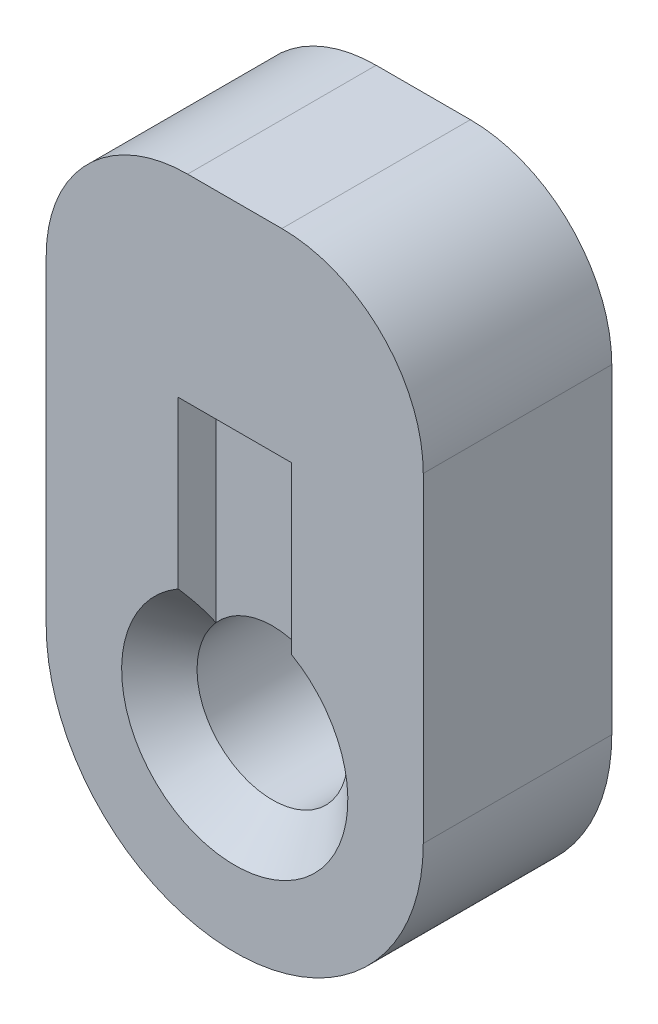
ISO-10303-21;
HEADER;
FILE_DESCRIPTION(('STEP AP214'),'2;1');
FILE_NAME('part.step','',(''),(''),'','','');
FILE_SCHEMA(('AUTOMOTIVE_DESIGN { 1 0 10303 214 1 1 1 1 }'));
ENDSEC;
DATA;
#1=APPLICATION_CONTEXT('core data for automotive mechanical design processes');
#2=APPLICATION_PROTOCOL_DEFINITION('international standard','automotive_design',2000,#1);
#3=PRODUCT_CONTEXT('',#1,'mechanical');
#4=PRODUCT('Part','Part','',(#3));
#5=PRODUCT_RELATED_PRODUCT_CATEGORY('part','',(#4));
#6=PRODUCT_DEFINITION_FORMATION('','',#4);
#7=PRODUCT_DEFINITION_CONTEXT('part definition',#1,'design');
#8=PRODUCT_DEFINITION('design','',#6,#7);
#9=PRODUCT_DEFINITION_SHAPE('','',#8);
#10=(LENGTH_UNIT() NAMED_UNIT(*) SI_UNIT(.MILLI.,.METRE.));
#11=(NAMED_UNIT(*) PLANE_ANGLE_UNIT() SI_UNIT($,.RADIAN.));
#12=(NAMED_UNIT(*) SI_UNIT($,.STERADIAN.) SOLID_ANGLE_UNIT());
#13=UNCERTAINTY_MEASURE_WITH_UNIT(LENGTH_MEASURE(1.E-05),#10,'distance_accuracy_value','');
#14=(GEOMETRIC_REPRESENTATION_CONTEXT(3) GLOBAL_UNCERTAINTY_ASSIGNED_CONTEXT((#13)) GLOBAL_UNIT_ASSIGNED_CONTEXT((#10,
#11,#12)) REPRESENTATION_CONTEXT('',''));
#15=CARTESIAN_POINT('',(0.,0.,0.));
#16=DIRECTION('',(0.,0.,1.));
#17=DIRECTION('',(1.,0.,0.));
#18=AXIS2_PLACEMENT_3D('',#15,#16,#17);
#19=CARTESIAN_POINT('',(0.,0.,2.54));
#20=DIRECTION('',(0.,0.,-1.));
#21=DIRECTION('',(-1.,0.,0.));
#22=AXIS2_PLACEMENT_3D('',#19,#20,#21);
#23=CYLINDRICAL_SURFACE('',#22,1.016);
#24=CARTESIAN_POINT('',(0.,0.,0.508));
#25=DIRECTION('',(0.,0.,-1.));
#26=DIRECTION('',(-1.,0.,0.));
#27=AXIS2_PLACEMENT_3D('',#24,#25,#26);
#28=CIRCLE('',#27,1.016);
#29=CARTESIAN_POINT('',(0.762,0.672020833010429,0.508));
#30=VERTEX_POINT('',#29);
#31=CARTESIAN_POINT('',(-0.762000000000013,0.672020833010416,0.508));
#32=VERTEX_POINT('',#31);
#33=EDGE_CURVE('E562',#30,#32,#28,.F.);
#34=ORIENTED_EDGE('',*,*,#33,.F.);
#35=CARTESIAN_POINT('',(0.,0.,0.508000000000016));
#36=DIRECTION('',(0.,0.,-1.));
#37=DIRECTION('',(-1.,0.,0.));
#38=AXIS2_PLACEMENT_3D('',#35,#36,#37);
#39=CIRCLE('',#38,1.016);
#40=EDGE_CURVE('E143',#30,#32,#39,.T.);
#41=ORIENTED_EDGE('',*,*,#40,.T.);
#42=EDGE_LOOP('',(#34,#41));
#43=FACE_BOUND('',#42,.T.);
#44=CARTESIAN_POINT('',(0.,0.,2.032));
#45=DIRECTION('',(0.,0.,1.));
#46=DIRECTION('',(1.,0.,0.));
#47=AXIS2_PLACEMENT_3D('',#44,#45,#46);
#48=CIRCLE('',#47,1.016);
#49=CARTESIAN_POINT('',(-0.762000000000001,0.672020833010413,2.032));
#50=VERTEX_POINT('',#49);
#51=CARTESIAN_POINT('',(0.762000000000004,0.672020833010409,2.032));
#52=VERTEX_POINT('',#51);
#53=EDGE_CURVE('E192',#50,#52,#48,.F.);
#54=ORIENTED_EDGE('',*,*,#53,.F.);
#55=CARTESIAN_POINT('',(0.,0.,2.03199999999999));
#56=DIRECTION('',(0.,0.,1.));
#57=DIRECTION('',(1.,0.,0.));
#58=AXIS2_PLACEMENT_3D('',#55,#56,#57);
#59=CIRCLE('',#58,1.016);
#60=EDGE_CURVE('E165',#50,#52,#59,.T.);
#61=ORIENTED_EDGE('',*,*,#60,.T.);
#62=EDGE_LOOP('',(#54,#61));
#63=FACE_BOUND('',#62,.T.);
#64=ADVANCED_FACE('F41',(#43,#63),#23,.F.);
#65=CARTESIAN_POINT('',(-0.762000000000001,0.,2.032));
#66=DIRECTION('',(-1.,0.,0.));
#67=DIRECTION('',(0.,0.,1.));
#68=AXIS2_PLACEMENT_3D('',#65,#66,#67);
#69=PLANE('',#68);
#70=CARTESIAN_POINT('',(-0.762000000000001,-0.320112885029406,1.84250847494859));
#71=CARTESIAN_POINT('',(-0.762000000000001,-0.295333553365384,1.83290636944236));
#72=CARTESIAN_POINT('',(-0.762000000000001,-0.270205778967705,1.82412531153175));
#73=CARTESIAN_POINT('',(-0.762000000000001,-0.219279308727766,1.80855318599059));
#74=CARTESIAN_POINT('',(-0.762000000000001,-0.193479145095385,1.80176695346473));
#75=CARTESIAN_POINT('',(-0.762000000000001,-0.141824715607705,1.79068312579393));
#76=CARTESIAN_POINT('',(-0.762000000000001,-0.115979848676879,1.78634278389228));
#77=CARTESIAN_POINT('',(-0.762000000000001,-0.0640080043353284,1.78024889633141));
#78=CARTESIAN_POINT('',(-0.762000000000001,-0.0378813393353045,1.7784927338415));
#79=CARTESIAN_POINT('',(-0.762000000000001,0.0135364612752595,1.77770144140581));
#80=CARTESIAN_POINT('',(-0.762000000000001,0.0388261998534757,1.77857693857625));
#81=CARTESIAN_POINT('',(-0.762000000000001,0.089204692449845,1.78279152828026));
#82=CARTESIAN_POINT('',(-0.762000000000001,0.114293344654479,1.78613179782516));
#83=CARTESIAN_POINT('',(-0.762000000000001,0.188998481514829,1.79956372082769));
#84=CARTESIAN_POINT('',(-0.762000000000001,0.238010241197525,1.81306659996416));
#85=CARTESIAN_POINT('',(-0.762000000000001,0.335647478318469,1.84732319180735));
#86=CARTESIAN_POINT('',(-0.762000000000001,0.384165580939922,1.86836391130572));
#87=CARTESIAN_POINT('',(-0.762000000000001,0.478965921312955,1.91508463327411));
#88=CARTESIAN_POINT('',(-0.762000000000001,0.525243542700618,1.94077373742472));
#89=CARTESIAN_POINT('',(-0.762000000000001,0.616770009042437,1.99563444778393));
#90=CARTESIAN_POINT('',(-0.762000000000001,0.661986045509693,2.02485974331733));
#91=CARTESIAN_POINT('',(-0.762000000000001,0.750951469043454,2.08535304604002));
#92=CARTESIAN_POINT('',(-0.762000000000001,0.794702182311347,2.11661912622096));
#93=CARTESIAN_POINT('',(-0.762000000000001,0.911413460169346,2.2029502583023));
#94=CARTESIAN_POINT('',(-0.762000000000001,0.983379073223906,2.25935171884097));
#95=CARTESIAN_POINT('',(-0.762000000000001,1.12542139977116,2.37449674969511));
#96=CARTESIAN_POINT('',(-0.762000000000001,1.19549743360379,2.43324114438863));
#97=CARTESIAN_POINT('',(-0.762000000000001,1.33448584164571,2.55229764416072));
#98=CARTESIAN_POINT('',(-0.762000000000001,1.40339628502007,2.61261199660617));
#99=CARTESIAN_POINT('',(-0.762000000000001,1.54034092149377,2.73422808104102));
#100=CARTESIAN_POINT('',(-0.762000000000001,1.60837508129857,2.79552985034949));
#101=CARTESIAN_POINT('',(-0.762000000000001,1.73708890097997,2.9127042284456));
#102=CARTESIAN_POINT('',(-0.762000000000001,1.79782808883558,2.96851157096941));
#103=CARTESIAN_POINT('',(-0.762000000000001,1.91891904470457,3.08055019785734));
#104=CARTESIAN_POINT('',(-0.762000000000001,1.97927079436488,3.13678150203428));
#105=CARTESIAN_POINT('',(-0.762000000000001,2.09948522538936,3.24939197548309));
#106=CARTESIAN_POINT('',(-0.762000000000001,2.15934884272821,3.3057701466671));
#107=CARTESIAN_POINT('',(-0.762000000000001,2.27883046181757,3.41877836535408));
#108=CARTESIAN_POINT('',(-0.762000000000001,2.33844847952092,3.47540839598437));
#109=CARTESIAN_POINT('',(-0.762000000000001,2.39797516397831,3.53213371803982));
#110=B_SPLINE_CURVE_WITH_KNOTS('',3,(#70,#71,#72,#73,#74,#75,#76,#77,#78,#79,#80,#81,#82,#83,
#84,#85,#86,#87,#88,#89,#90,#91,#92,#93,#94,#95,#96,#97,#98,#99,#100,#101,#102,#103,#104,#105,
#106,#107,#108,#109),.UNSPECIFIED.,.F.,.F.,(4,2,2,2,2,2,2,2,2,2,2,2,2,2,2,2,2,2,2,4),(0.,
0.0797522408543494,0.159696222594933,0.238195867700949,0.31661596647901,0.392403294084258,
0.468226836116276,0.620003493762815,0.778311228022764,0.936932355595322,1.09836706998341,
1.25965149539109,1.53385513955007,1.80815613042058,2.08287409239533,2.35760246171224,
2.60505370840901,2.85251659170748,3.0992126774344,3.34589247812601),.UNSPECIFIED.);
#111=CARTESIAN_POINT('',(-0.762000000000001,1.31982271536748,2.54));
#112=VERTEX_POINT('',#111);
#113=EDGE_CURVE('E172',#50,#112,#110,.T.);
#114=ORIENTED_EDGE('',*,*,#113,.F.);
#115=DIRECTION('',(0.,-1.,0.));
#116=VECTOR('',#115,1.);
#117=CARTESIAN_POINT('',(-0.762000000000001,0.,2.032));
#118=LINE('',#117,#116);
#119=CARTESIAN_POINT('',(-0.762000000000001,3.556,2.032));
#120=VERTEX_POINT('',#119);
#121=EDGE_CURVE('E188',#120,#50,#118,.T.);
#122=ORIENTED_EDGE('',*,*,#121,.F.);
#123=DIRECTION('',(0.,0.,1.));
#124=VECTOR('',#123,1.);
#125=CARTESIAN_POINT('',(-0.762000000000001,3.556,2.032));
#126=LINE('',#125,#124);
#127=CARTESIAN_POINT('',(-0.762000000000001,3.556,2.54));
#128=VERTEX_POINT('',#127);
#129=EDGE_CURVE('E215',#120,#128,#126,.T.);
#130=ORIENTED_EDGE('',*,*,#129,.T.);
#131=DIRECTION('',(0.,-1.,0.));
#132=VECTOR('',#131,1.);
#133=CARTESIAN_POINT('',(-0.762000000000001,0.,2.54));
#134=LINE('',#133,#132);
#135=EDGE_CURVE('E183',#128,#112,#134,.T.);
#136=ORIENTED_EDGE('',*,*,#135,.T.);
#137=EDGE_LOOP('',(#114,#122,#130,#136));
#138=FACE_BOUND('',#137,.T.);
#139=ADVANCED_FACE('F315',(#138),#69,.F.);
#140=CARTESIAN_POINT('',(0.762000000000001,0.,2.032));
#141=DIRECTION('',(1.,0.,0.));
#142=DIRECTION('',(0.,1.,0.));
#143=AXIS2_PLACEMENT_3D('',#140,#141,#142);
#144=PLANE('',#143);
#145=CARTESIAN_POINT('',(0.762,2.39797516397831,3.53213371803981));
#146=CARTESIAN_POINT('',(0.762,2.32873931674914,3.46616039267172));
#147=CARTESIAN_POINT('',(0.762,2.25938285096078,3.40031275907171));
#148=CARTESIAN_POINT('',(0.762,2.12032476999515,3.26897252871197));
#149=CARTESIAN_POINT('',(0.762,2.050623129003,3.20347995929806));
#150=CARTESIAN_POINT('',(0.762,1.91093693713539,3.07310884917095));
#151=CARTESIAN_POINT('',(0.762,1.840953361568,3.0082292660561));
#152=CARTESIAN_POINT('',(0.762,1.70039435861494,2.87912022187955));
#153=CARTESIAN_POINT('',(0.762,1.6298189537208,2.81489073631485));
#154=CARTESIAN_POINT('',(0.762,1.46664134261578,2.66827439786695));
#155=CARTESIAN_POINT('',(0.762,1.3737586389346,2.58619666171781));
#156=CARTESIAN_POINT('',(0.762,1.23263801134836,2.46495534199683));
#157=CARTESIAN_POINT('',(0.762,1.18524464164697,2.42481050048725));
#158=CARTESIAN_POINT('',(0.762,1.08970679767788,2.34543347189523));
#159=CARTESIAN_POINT('',(0.762,1.04156242296529,2.30620116553391));
#160=CARTESIAN_POINT('',(0.762,0.947477847785198,2.23156286423435));
#161=CARTESIAN_POINT('',(0.762,0.901602549094888,2.19607544441393));
#162=CARTESIAN_POINT('',(0.762,0.80866866053499,2.12668940794581));
#163=CARTESIAN_POINT('',(0.762,0.761610291067495,2.09279049868499));
#164=CARTESIAN_POINT('',(0.762,0.665924682694298,2.02737427180279));
#165=CARTESIAN_POINT('',(0.762,0.617299242056743,1.99585435397701));
#166=CARTESIAN_POINT('',(0.762,0.517890221653922,1.93646959833464));
#167=CARTESIAN_POINT('',(0.762000000000001,0.467109404827834,1.90860025772468));
#168=CARTESIAN_POINT('',(0.762000000000001,0.367695882962378,1.861058228643));
#169=CARTESIAN_POINT('',(0.762000000000001,0.31932355521645,1.84085603108713));
#170=CARTESIAN_POINT('',(0.762000000000001,0.220205152376706,1.8078278857344));
#171=CARTESIAN_POINT('',(0.762000000000001,0.169471551906662,1.79496708311052));
#172=CARTESIAN_POINT('',(0.762000000000001,0.0918201824293839,1.7830719736912));
#173=CARTESIAN_POINT('',(0.762000000000001,0.0654557860224722,1.78034861998438));
#174=CARTESIAN_POINT('',(0.762000000000001,0.0125801610505859,1.77764797533753));
#175=CARTESIAN_POINT('',(0.762000000000001,-0.0139310649855619,1.77767063724941));
#176=CARTESIAN_POINT('',(0.762000000000001,-0.0668797202015237,1.78047036915518));
#177=CARTESIAN_POINT('',(0.762000000000001,-0.0933167177784668,1.78325536159827));
#178=CARTESIAN_POINT('',(0.762000000000001,-0.145795105763024,1.79138862314452));
#179=CARTESIAN_POINT('',(0.762000000000001,-0.171836374335675,1.79673766579477));
#180=CARTESIAN_POINT('',(0.762000000000001,-0.218464555083557,1.80844029670378));
#181=CARTESIAN_POINT('',(0.762000000000001,-0.23915007949053,1.81441154810352));
#182=CARTESIAN_POINT('',(0.762000000000001,-0.279998495995666,1.82758572915144));
#183=CARTESIAN_POINT('',(0.762000000000001,-0.30016367422565,1.83478153796503));
#184=CARTESIAN_POINT('',(0.762000000000001,-0.320112885029432,1.84250847494848));
#185=B_SPLINE_CURVE_WITH_KNOTS('',3,(#145,#146,#147,#148,#149,#150,#151,#152,#153,#154,#155,
#156,#157,#158,#159,#160,#161,#162,#163,#164,#165,#166,#167,#168,#169,#170,#171,#172,#173,#174,
#175,#176,#177,#178,#179,#180,#181,#182,#183,#184),.UNSPECIFIED.,.F.,.F.,(4,2,2,2,2,2,2,2,2,2,2,
2,2,2,2,2,2,2,2,4),(0.,0.28690614863427,0.573834088531817,0.860123242809433,1.14640156599761,
1.51822037764353,1.70454484153626,1.89084481222558,2.06481940011078,2.23876181383742,
2.41251127181324,2.58604435947118,2.74295026876841,2.89910490214274,2.97849141537674,
3.05787656557321,3.13749005510215,3.21712757831782,3.28167668025887,3.34586250911327),.UNSPECIFIED.);
#186=CARTESIAN_POINT('',(0.762,1.31982271536748,2.54));
#187=VERTEX_POINT('',#186);
#188=EDGE_CURVE('E344',#187,#52,#185,.T.);
#189=ORIENTED_EDGE('',*,*,#188,.F.);
#190=DIRECTION('',(0.,1.,0.));
#191=VECTOR('',#190,1.);
#192=CARTESIAN_POINT('',(0.762000000000001,0.,2.54));
#193=LINE('',#192,#191);
#194=CARTESIAN_POINT('',(0.761999999999999,3.556,2.54));
#195=VERTEX_POINT('',#194);
#196=EDGE_CURVE('E209',#187,#195,#193,.T.);
#197=ORIENTED_EDGE('',*,*,#196,.T.);
#198=DIRECTION('',(0.,0.,1.));
#199=VECTOR('',#198,1.);
#200=CARTESIAN_POINT('',(0.761999999999999,3.556,2.032));
#201=LINE('',#200,#199);
#202=CARTESIAN_POINT('',(0.761999999999999,3.556,2.032));
#203=VERTEX_POINT('',#202);
#204=EDGE_CURVE('E205',#203,#195,#201,.T.);
#205=ORIENTED_EDGE('',*,*,#204,.F.);
#206=DIRECTION('',(0.,1.,0.));
#207=VECTOR('',#206,1.);
#208=CARTESIAN_POINT('',(0.762000000000001,0.,2.032));
#209=LINE('',#208,#207);
#210=EDGE_CURVE('E197',#52,#203,#209,.T.);
#211=ORIENTED_EDGE('',*,*,#210,.F.);
#212=EDGE_LOOP('',(#189,#197,#205,#211));
#213=FACE_BOUND('',#212,.T.);
#214=ADVANCED_FACE('F321',(#213),#144,.F.);
#215=CARTESIAN_POINT('',(0.762000000000001,0.,0.508));
#216=DIRECTION('',(1.,0.,0.));
#217=DIRECTION('',(0.,1.,0.));
#218=AXIS2_PLACEMENT_3D('',#215,#216,#217);
#219=PLANE('',#218);
#220=CARTESIAN_POINT('',(0.762000000000001,-0.320112885029424,0.697491525051413));
#221=CARTESIAN_POINT('',(0.762000000000001,-0.2953335533654,0.707093630557645));
#222=CARTESIAN_POINT('',(0.762000000000001,-0.27020577896772,0.715874688468248));
#223=CARTESIAN_POINT('',(0.762000000000001,-0.219279308727779,0.731446814009408));
#224=CARTESIAN_POINT('',(0.762000000000001,-0.193479145095397,0.738233046535275));
#225=CARTESIAN_POINT('',(0.762000000000001,-0.141824715607715,0.749316874206072));
#226=CARTESIAN_POINT('',(0.762000000000001,-0.115979848676887,0.753657216107724));
#227=CARTESIAN_POINT('',(0.762000000000001,-0.0640080043353342,0.759751103668595));
#228=CARTESIAN_POINT('',(0.762000000000001,-0.037881339335309,0.761507266158503));
#229=CARTESIAN_POINT('',(0.762000000000001,0.0135364612752571,0.762298558594195));
#230=CARTESIAN_POINT('',(0.762000000000001,0.0388261998534742,0.761423061423751));
#231=CARTESIAN_POINT('',(0.762000000000001,0.0892046924498453,0.757208471719742));
#232=CARTESIAN_POINT('',(0.762000000000001,0.11429334465448,0.753868202174842));
#233=CARTESIAN_POINT('',(0.762000000000001,0.188998481514833,0.740436279172312));
#234=CARTESIAN_POINT('',(0.762000000000001,0.238010241197531,0.726933400035848));
#235=CARTESIAN_POINT('',(0.762000000000001,0.335647478318479,0.692676808192649));
#236=CARTESIAN_POINT('',(0.762000000000001,0.384165580939933,0.671636088694282));
#237=CARTESIAN_POINT('',(0.762000000000001,0.47896592131297,0.624915366725886));
#238=CARTESIAN_POINT('',(0.762,0.525243542700636,0.59922626257528));
#239=CARTESIAN_POINT('',(0.762,0.616770009042458,0.544365552216063));
#240=CARTESIAN_POINT('',(0.762,0.661986045509717,0.515140256682668));
#241=CARTESIAN_POINT('',(0.762,0.750951469043482,0.454646953959971));
#242=CARTESIAN_POINT('',(0.762,0.794702182311376,0.423380873779028));
#243=CARTESIAN_POINT('',(0.762,0.911413460169378,0.33704974169769));
#244=CARTESIAN_POINT('',(0.762,0.983379073223939,0.280648281159015));
#245=CARTESIAN_POINT('',(0.762,1.1254213997712,0.165503250304881));
#246=CARTESIAN_POINT('',(0.762,1.19549743360383,0.106758855611355));
#247=CARTESIAN_POINT('',(0.762,1.33448584164575,-0.0122976441607343));
#248=CARTESIAN_POINT('',(0.762,1.40339628502011,-0.0726119966061819));
#249=CARTESIAN_POINT('',(0.762,1.54034092149381,-0.194228081041035));
#250=CARTESIAN_POINT('',(0.762,1.60837508129862,-0.255529850349503));
#251=CARTESIAN_POINT('',(0.762,1.73708890098001,-0.372704228445616));
#252=CARTESIAN_POINT('',(0.762,1.79782808883563,-0.42851157096942));
#253=CARTESIAN_POINT('',(0.762,1.91891904470461,-0.540550197857357));
#254=CARTESIAN_POINT('',(0.762,1.97927079436492,-0.596781502034295));
#255=CARTESIAN_POINT('',(0.762,2.09948522538942,-0.709391975483098));
#256=CARTESIAN_POINT('',(0.762,2.15934884272826,-0.765770146667111));
#257=CARTESIAN_POINT('',(0.762,2.27883046181762,-0.878778365354089));
#258=CARTESIAN_POINT('',(0.762,2.33844847952097,-0.935408395984384));
#259=CARTESIAN_POINT('',(0.762,2.39797516397837,-0.99213371803983));
#260=B_SPLINE_CURVE_WITH_KNOTS('',3,(#220,#221,#222,#223,#224,#225,#226,#227,#228,#229,#230,
#231,#232,#233,#234,#235,#236,#237,#238,#239,#240,#241,#242,#243,#244,#245,#246,#247,#248,#249,
#250,#251,#252,#253,#254,#255,#256,#257,#258,#259),.UNSPECIFIED.,.F.,.F.,(4,2,2,2,2,2,2,2,2,2,2,
2,2,2,2,2,2,2,2,4),(0.,0.0797522408543532,0.159696222594941,0.23819586770096,0.316615966479025,
0.392403294084276,0.468226836116297,0.620003493762841,0.778311228022797,0.936932355595361,
1.09836706998345,1.25965149539114,1.53385513955013,1.80815613042064,2.08287409239539,
2.3576024617123,2.60505370840908,2.85251659170755,3.09921267743447,3.34589247812608),.UNSPECIFIED.);
#261=CARTESIAN_POINT('',(0.762,1.31982271536751,0.));
#262=VERTEX_POINT('',#261);
#263=EDGE_CURVE('E140',#30,#262,#260,.T.);
#264=ORIENTED_EDGE('',*,*,#263,.F.);
#265=DIRECTION('',(0.,-1.,0.));
#266=VECTOR('',#265,1.);
#267=CARTESIAN_POINT('',(0.762000000000001,0.,0.508));
#268=LINE('',#267,#266);
#269=CARTESIAN_POINT('',(0.761999999999999,3.556,0.508));
#270=VERTEX_POINT('',#269);
#271=EDGE_CURVE('E180',#270,#30,#268,.T.);
#272=ORIENTED_EDGE('',*,*,#271,.F.);
#273=DIRECTION('',(0.,0.,-1.));
#274=VECTOR('',#273,1.);
#275=CARTESIAN_POINT('',(0.761999999999999,3.556,0.508));
#276=LINE('',#275,#274);
#277=CARTESIAN_POINT('',(0.761999999999999,3.556,0.));
#278=VERTEX_POINT('',#277);
#279=EDGE_CURVE('E162',#270,#278,#276,.T.);
#280=ORIENTED_EDGE('',*,*,#279,.T.);
#281=DIRECTION('',(0.,-1.,0.));
#282=VECTOR('',#281,1.);
#283=CARTESIAN_POINT('',(0.762000000000001,0.,0.));
#284=LINE('',#283,#282);
#285=EDGE_CURVE('E157',#278,#262,#284,.T.);
#286=ORIENTED_EDGE('',*,*,#285,.T.);
#287=EDGE_LOOP('',(#264,#272,#280,#286));
#288=FACE_BOUND('',#287,.T.);
#289=ADVANCED_FACE('F161',(#288),#219,.F.);
#290=CARTESIAN_POINT('',(-0.762000000000001,0.,0.508));
#291=DIRECTION('',(-1.,0.,0.));
#292=DIRECTION('',(0.,0.,1.));
#293=AXIS2_PLACEMENT_3D('',#290,#291,#292);
#294=PLANE('',#293);
#295=CARTESIAN_POINT('',(-0.762000000000001,2.39797516397838,-0.992133718039835));
#296=CARTESIAN_POINT('',(-0.762000000000001,2.3287393167492,-0.92616039267174));
#297=CARTESIAN_POINT('',(-0.762000000000001,2.25938285096084,-0.860312759071731));
#298=CARTESIAN_POINT('',(-0.762000000000001,2.12032476999521,-0.728972528711984));
#299=CARTESIAN_POINT('',(-0.762000000000001,2.05062312900305,-0.663479959298074));
#300=CARTESIAN_POINT('',(-0.762000000000001,1.91093693713544,-0.533108849170966));
#301=CARTESIAN_POINT('',(-0.762000000000001,1.84095336156804,-0.468229266056115));
#302=CARTESIAN_POINT('',(-0.762000000000001,1.70039435861499,-0.339120221879564));
#303=CARTESIAN_POINT('',(-0.762000000000001,1.62981895372084,-0.274890736314859));
#304=CARTESIAN_POINT('',(-0.762000000000001,1.46664134261582,-0.128274397866957));
#305=CARTESIAN_POINT('',(-0.762000000000001,1.37375863893464,-0.0461966617178121));
#306=CARTESIAN_POINT('',(-0.762000000000001,1.23263801134839,0.0750446580031614));
#307=CARTESIAN_POINT('',(-0.762000000000001,1.18524464164699,0.115189499512746));
#308=CARTESIAN_POINT('',(-0.762000000000001,1.0897067976779,0.194566528104768));
#309=CARTESIAN_POINT('',(-0.762000000000001,1.04156242296531,0.233798834466091));
#310=CARTESIAN_POINT('',(-0.762000000000001,0.947477847785219,0.308437135765644));
#311=CARTESIAN_POINT('',(-0.762000000000001,0.901602549094908,0.343924555586069));
#312=CARTESIAN_POINT('',(-0.762000000000001,0.808668660535009,0.413310592054184));
#313=CARTESIAN_POINT('',(-0.762000000000001,0.761610291067513,0.447209501315008));
#314=CARTESIAN_POINT('',(-0.762000000000001,0.665924682694314,0.512625728197209));
#315=CARTESIAN_POINT('',(-0.762000000000001,0.617299242056758,0.544145646022987));
#316=CARTESIAN_POINT('',(-0.762000000000001,0.517890221653935,0.603530401665366));
#317=CARTESIAN_POINT('',(-0.762000000000001,0.467109404827846,0.631399742275319));
#318=CARTESIAN_POINT('',(-0.762000000000001,0.367695882962388,0.678941771356999));
#319=CARTESIAN_POINT('',(-0.762000000000001,0.319323555216459,0.699143968912871));
#320=CARTESIAN_POINT('',(-0.762000000000001,0.220205152376712,0.732172114265605));
#321=CARTESIAN_POINT('',(-0.762000000000001,0.169471551906666,0.745032916889488));
#322=CARTESIAN_POINT('',(-0.762000000000001,0.0918201824293863,0.756928026308806));
#323=CARTESIAN_POINT('',(-0.762000000000001,0.0654557860224739,0.759651380015625));
#324=CARTESIAN_POINT('',(-0.762000000000001,0.0125801610505861,0.762352024662472));
#325=CARTESIAN_POINT('',(-0.762000000000001,-0.0139310649855625,0.762329362750596));
#326=CARTESIAN_POINT('',(-0.762000000000001,-0.0668797202015259,0.759529630844824));
#327=CARTESIAN_POINT('',(-0.762000000000001,-0.09331671777847,0.756744638401739));
#328=CARTESIAN_POINT('',(-0.762000000000001,-0.145795105763029,0.748611376855485));
#329=CARTESIAN_POINT('',(-0.762000000000001,-0.17183637433568,0.743262334205238));
#330=CARTESIAN_POINT('',(-0.762000000000001,-0.218464555083565,0.731559703296227));
#331=CARTESIAN_POINT('',(-0.762000000000001,-0.239150079490541,0.725588451896481));
#332=CARTESIAN_POINT('',(-0.762000000000001,-0.279998495995681,0.712414270848565));
#333=CARTESIAN_POINT('',(-0.762000000000001,-0.300163674225667,0.70521846203497));
#334=CARTESIAN_POINT('',(-0.762000000000001,-0.320112885029451,0.69749152505152));
#335=B_SPLINE_CURVE_WITH_KNOTS('',3,(#295,#296,#297,#298,#299,#300,#301,#302,#303,#304,#305,
#306,#307,#308,#309,#310,#311,#312,#313,#314,#315,#316,#317,#318,#319,#320,#321,#322,#323,#324,
#325,#326,#327,#328,#329,#330,#331,#332,#333,#334),.UNSPECIFIED.,.F.,.F.,(4,2,2,2,2,2,2,2,2,2,2,
2,2,2,2,2,2,2,2,4),(0.,0.286906148634278,0.573834088531832,0.860123242809456,1.14640156599764,
1.51822037764357,1.7045448415363,1.89084481222563,2.06481940011083,2.23876181383748,
2.4125112718133,2.58604435947124,2.74295026876847,2.89910490214281,2.97849141537681,
3.05787656557328,3.13749005510222,3.21712757831789,3.28167668025895,3.34586250911335),.UNSPECIFIED.);
#336=CARTESIAN_POINT('',(-0.762000000000001,1.31982271536751,0.));
#337=VERTEX_POINT('',#336);
#338=EDGE_CURVE('E149',#337,#32,#335,.T.);
#339=ORIENTED_EDGE('',*,*,#338,.F.);
#340=DIRECTION('',(0.,1.,0.));
#341=VECTOR('',#340,1.);
#342=CARTESIAN_POINT('',(-0.762000000000001,0.,0.));
#343=LINE('',#342,#341);
#344=CARTESIAN_POINT('',(-0.762000000000001,3.556,0.));
#345=VERTEX_POINT('',#344);
#346=EDGE_CURVE('E158',#337,#345,#343,.T.);
#347=ORIENTED_EDGE('',*,*,#346,.T.);
#348=DIRECTION('',(0.,0.,-1.));
#349=VECTOR('',#348,1.);
#350=CARTESIAN_POINT('',(-0.762000000000001,3.556,0.508));
#351=LINE('',#350,#349);
#352=CARTESIAN_POINT('',(-0.762000000000001,3.556,0.508));
#353=VERTEX_POINT('',#352);
#354=EDGE_CURVE('E184',#353,#345,#351,.T.);
#355=ORIENTED_EDGE('',*,*,#354,.F.);
#356=DIRECTION('',(0.,1.,0.));
#357=VECTOR('',#356,1.);
#358=CARTESIAN_POINT('',(-0.762000000000001,0.,0.508));
#359=LINE('',#358,#357);
#360=EDGE_CURVE('E564',#32,#353,#359,.T.);
#361=ORIENTED_EDGE('',*,*,#360,.F.);
#362=EDGE_LOOP('',(#339,#347,#355,#361));
#363=FACE_BOUND('',#362,.T.);
#364=ADVANCED_FACE('F367',(#363),#294,.F.);
#365=CARTESIAN_POINT('',(-2.54,0.,2.54));
#366=DIRECTION('',(-1.,0.,0.));
#367=DIRECTION('',(0.,0.,1.));
#368=AXIS2_PLACEMENT_3D('',#365,#366,#367);
#369=PLANE('',#368);
#370=DIRECTION('',(0.,1.,0.));
#371=VECTOR('',#370,1.);
#372=CARTESIAN_POINT('',(-2.54,0.,0.));
#373=LINE('',#372,#371);
#374=CARTESIAN_POINT('',(-2.54,0.,0.));
#375=VERTEX_POINT('',#374);
#376=CARTESIAN_POINT('',(-2.54,4.318,0.));
#377=VERTEX_POINT('',#376);
#378=EDGE_CURVE('E218',#375,#377,#373,.T.);
#379=ORIENTED_EDGE('',*,*,#378,.F.);
#380=DIRECTION('',(0.,0.,-1.));
#381=VECTOR('',#380,1.);
#382=CARTESIAN_POINT('',(-2.54,0.,2.54));
#383=LINE('',#382,#381);
#384=CARTESIAN_POINT('',(-2.54,0.,2.54));
#385=VERTEX_POINT('',#384);
#386=EDGE_CURVE('E11',#385,#375,#383,.T.);
#387=ORIENTED_EDGE('',*,*,#386,.F.);
#388=DIRECTION('',(0.,1.,0.));
#389=VECTOR('',#388,1.);
#390=CARTESIAN_POINT('',(-2.54,0.,2.54));
#391=LINE('',#390,#389);
#392=CARTESIAN_POINT('',(-2.54,4.318,2.54));
#393=VERTEX_POINT('',#392);
#394=EDGE_CURVE('E222',#385,#393,#391,.T.);
#395=ORIENTED_EDGE('',*,*,#394,.T.);
#396=DIRECTION('',(0.,0.,-1.));
#397=VECTOR('',#396,1.);
#398=CARTESIAN_POINT('',(-2.54,4.318,2.54));
#399=LINE('',#398,#397);
#400=EDGE_CURVE('E244',#393,#377,#399,.T.);
#401=ORIENTED_EDGE('',*,*,#400,.T.);
#402=EDGE_LOOP('',(#379,#387,#395,#401));
#403=FACE_BOUND('',#402,.T.);
#404=ADVANCED_FACE('F43',(#403),#369,.T.);
#405=CARTESIAN_POINT('',(0.,0.,2.54));
#406=DIRECTION('',(0.,0.,-1.));
#407=DIRECTION('',(-1.,0.,0.));
#408=AXIS2_PLACEMENT_3D('',#405,#406,#407);
#409=CYLINDRICAL_SURFACE('',#408,2.54);
#410=CARTESIAN_POINT('',(0.,0.,0.));
#411=DIRECTION('',(0.,0.,1.));
#412=DIRECTION('',(1.,0.,0.));
#413=AXIS2_PLACEMENT_3D('',#410,#411,#412);
#414=CIRCLE('',#413,2.54);
#415=CARTESIAN_POINT('',(2.54,0.,0.));
#416=VERTEX_POINT('',#415);
#417=EDGE_CURVE('E248',#375,#416,#414,.T.);
#418=ORIENTED_EDGE('',*,*,#417,.T.);
#419=DIRECTION('',(0.,0.,-1.));
#420=VECTOR('',#419,1.);
#421=CARTESIAN_POINT('',(2.54,0.,2.54));
#422=LINE('',#421,#420);
#423=CARTESIAN_POINT('',(2.54,0.,2.54));
#424=VERTEX_POINT('',#423);
#425=EDGE_CURVE('E50',#424,#416,#422,.T.);
#426=ORIENTED_EDGE('',*,*,#425,.F.);
#427=CARTESIAN_POINT('',(0.,0.,2.54));
#428=DIRECTION('',(0.,0.,1.));
#429=DIRECTION('',(1.,0.,0.));
#430=AXIS2_PLACEMENT_3D('',#427,#428,#429);
#431=CIRCLE('',#430,2.54);
#432=EDGE_CURVE('E226',#385,#424,#431,.T.);
#433=ORIENTED_EDGE('',*,*,#432,.F.);
#434=ORIENTED_EDGE('',*,*,#386,.T.);
#435=EDGE_LOOP('',(#418,#426,#433,#434));
#436=FACE_BOUND('',#435,.T.);
#437=ADVANCED_FACE('F299',(#436),#409,.T.);
#438=CARTESIAN_POINT('',(2.54,0.,2.54));
#439=DIRECTION('',(-1.,0.,0.));
#440=DIRECTION('',(0.,-1.,0.));
#441=AXIS2_PLACEMENT_3D('',#438,#439,#440);
#442=PLANE('',#441);
#443=DIRECTION('',(0.,1.,0.));
#444=VECTOR('',#443,1.);
#445=CARTESIAN_POINT('',(2.54,0.,0.));
#446=LINE('',#445,#444);
#447=CARTESIAN_POINT('',(2.54,4.318,0.));
#448=VERTEX_POINT('',#447);
#449=EDGE_CURVE('E251',#416,#448,#446,.T.);
#450=ORIENTED_EDGE('',*,*,#449,.T.);
#451=DIRECTION('',(0.,0.,-1.));
#452=VECTOR('',#451,1.);
#453=CARTESIAN_POINT('',(2.54,4.318,2.54));
#454=LINE('',#453,#452);
#455=CARTESIAN_POINT('',(2.54,4.318,2.54));
#456=VERTEX_POINT('',#455);
#457=EDGE_CURVE('E273',#456,#448,#454,.T.);
#458=ORIENTED_EDGE('',*,*,#457,.F.);
#459=DIRECTION('',(0.,1.,0.));
#460=VECTOR('',#459,1.);
#461=CARTESIAN_POINT('',(2.54,0.,2.54));
#462=LINE('',#461,#460);
#463=EDGE_CURVE('E230',#424,#456,#462,.T.);
#464=ORIENTED_EDGE('',*,*,#463,.F.);
#465=ORIENTED_EDGE('',*,*,#425,.T.);
#466=EDGE_LOOP('',(#450,#458,#464,#465));
#467=FACE_BOUND('',#466,.T.);
#468=ADVANCED_FACE('F282',(#467),#442,.F.);
#469=CARTESIAN_POINT('',(0.635,4.318,2.54));
#470=DIRECTION('',(0.,0.,-1.));
#471=DIRECTION('',(-1.,0.,0.));
#472=AXIS2_PLACEMENT_3D('',#469,#470,#471);
#473=CYLINDRICAL_SURFACE('',#472,1.905);
#474=CARTESIAN_POINT('',(0.635,4.318,0.));
#475=DIRECTION('',(0.,0.,1.));
#476=DIRECTION('',(1.,0.,0.));
#477=AXIS2_PLACEMENT_3D('',#474,#475,#476);
#478=CIRCLE('',#477,1.905);
#479=CARTESIAN_POINT('',(0.635,6.223,0.));
#480=VERTEX_POINT('',#479);
#481=EDGE_CURVE('E254',#448,#480,#478,.T.);
#482=ORIENTED_EDGE('',*,*,#481,.T.);
#483=DIRECTION('',(0.,0.,-1.));
#484=VECTOR('',#483,1.);
#485=CARTESIAN_POINT('',(0.635,6.223,2.54));
#486=LINE('',#485,#484);
#487=CARTESIAN_POINT('',(0.635,6.223,2.54));
#488=VERTEX_POINT('',#487);
#489=EDGE_CURVE('E270',#488,#480,#486,.T.);
#490=ORIENTED_EDGE('',*,*,#489,.F.);
#491=CARTESIAN_POINT('',(0.635,4.318,2.54));
#492=DIRECTION('',(0.,0.,1.));
#493=DIRECTION('',(1.,0.,0.));
#494=AXIS2_PLACEMENT_3D('',#491,#492,#493);
#495=CIRCLE('',#494,1.905);
#496=EDGE_CURVE('E233',#456,#488,#495,.T.);
#497=ORIENTED_EDGE('',*,*,#496,.F.);
#498=ORIENTED_EDGE('',*,*,#457,.T.);
#499=EDGE_LOOP('',(#482,#490,#497,#498));
#500=FACE_BOUND('',#499,.T.);
#501=ADVANCED_FACE('F292',(#500),#473,.T.);
#502=CARTESIAN_POINT('',(0.,6.223,2.54));
#503=DIRECTION('',(0.,1.,0.));
#504=DIRECTION('',(0.,0.,1.));
#505=AXIS2_PLACEMENT_3D('',#502,#503,#504);
#506=PLANE('',#505);
#507=DIRECTION('',(1.,0.,0.));
#508=VECTOR('',#507,1.);
#509=CARTESIAN_POINT('',(0.,6.223,0.));
#510=LINE('',#509,#508);
#511=CARTESIAN_POINT('',(-0.635,6.223,0.));
#512=VERTEX_POINT('',#511);
#513=EDGE_CURVE('E258',#512,#480,#510,.T.);
#514=ORIENTED_EDGE('',*,*,#513,.F.);
#515=DIRECTION('',(0.,0.,-1.));
#516=VECTOR('',#515,1.);
#517=CARTESIAN_POINT('',(-0.635,6.223,2.54));
#518=LINE('',#517,#516);
#519=CARTESIAN_POINT('',(-0.635,6.223,2.54));
#520=VERTEX_POINT('',#519);
#521=EDGE_CURVE('E267',#520,#512,#518,.T.);
#522=ORIENTED_EDGE('',*,*,#521,.F.);
#523=DIRECTION('',(1.,0.,0.));
#524=VECTOR('',#523,1.);
#525=CARTESIAN_POINT('',(0.,6.223,2.54));
#526=LINE('',#525,#524);
#527=EDGE_CURVE('E236',#520,#488,#526,.T.);
#528=ORIENTED_EDGE('',*,*,#527,.T.);
#529=ORIENTED_EDGE('',*,*,#489,.T.);
#530=EDGE_LOOP('',(#514,#522,#528,#529));
#531=FACE_BOUND('',#530,.T.);
#532=ADVANCED_FACE('F305',(#531),#506,.T.);
#533=CARTESIAN_POINT('',(-0.635,4.318,2.54));
#534=DIRECTION('',(0.,0.,-1.));
#535=DIRECTION('',(-1.,0.,0.));
#536=AXIS2_PLACEMENT_3D('',#533,#534,#535);
#537=CYLINDRICAL_SURFACE('',#536,1.905);
#538=CARTESIAN_POINT('',(-0.635,4.318,0.));
#539=DIRECTION('',(0.,0.,1.));
#540=DIRECTION('',(1.,0.,0.));
#541=AXIS2_PLACEMENT_3D('',#538,#539,#540);
#542=CIRCLE('',#541,1.905);
#543=EDGE_CURVE('E227',#377,#512,#542,.F.);
#544=ORIENTED_EDGE('',*,*,#543,.F.);
#545=ORIENTED_EDGE('',*,*,#400,.F.);
#546=CARTESIAN_POINT('',(-0.635,4.318,2.54));
#547=DIRECTION('',(0.,0.,1.));
#548=DIRECTION('',(1.,0.,0.));
#549=AXIS2_PLACEMENT_3D('',#546,#547,#548);
#550=CIRCLE('',#549,1.905);
#551=EDGE_CURVE('E240',#393,#520,#550,.F.);
#552=ORIENTED_EDGE('',*,*,#551,.T.);
#553=ORIENTED_EDGE('',*,*,#521,.T.);
#554=EDGE_LOOP('',(#544,#545,#552,#553));
#555=FACE_BOUND('',#554,.T.);
#556=ADVANCED_FACE('F303',(#555),#537,.T.);
#557=CARTESIAN_POINT('',(0.,0.,2.54));
#558=DIRECTION('',(0.,0.,1.));
#559=DIRECTION('',(1.,0.,0.));
#560=AXIS2_PLACEMENT_3D('',#557,#558,#559);
#561=PLANE('',#560);
#562=ORIENTED_EDGE('',*,*,#196,.F.);
#563=CARTESIAN_POINT('',(0.,0.,2.54));
#564=DIRECTION('',(0.,0.,-1.));
#565=DIRECTION('',(-1.,0.,0.));
#566=AXIS2_PLACEMENT_3D('',#563,#564,#565);
#567=CIRCLE('',#566,1.524);
#568=EDGE_CURVE('E57',#187,#112,#567,.T.);
#569=ORIENTED_EDGE('',*,*,#568,.T.);
#570=ORIENTED_EDGE('',*,*,#135,.F.);
#571=DIRECTION('',(-1.,0.,0.));
#572=VECTOR('',#571,1.);
#573=CARTESIAN_POINT('',(0.,3.556,2.54));
#574=LINE('',#573,#572);
#575=EDGE_CURVE('E193',#195,#128,#574,.T.);
#576=ORIENTED_EDGE('',*,*,#575,.F.);
#577=EDGE_LOOP('',(#562,#569,#570,#576));
#578=FACE_BOUND('',#577,.T.);
#579=ORIENTED_EDGE('',*,*,#394,.F.);
#580=ORIENTED_EDGE('',*,*,#432,.T.);
#581=ORIENTED_EDGE('',*,*,#463,.T.);
#582=ORIENTED_EDGE('',*,*,#496,.T.);
#583=ORIENTED_EDGE('',*,*,#527,.F.);
#584=ORIENTED_EDGE('',*,*,#551,.F.);
#585=EDGE_LOOP('',(#579,#580,#581,#582,#583,#584));
#586=FACE_BOUND('',#585,.T.);
#587=ADVANCED_FACE('F297',(#578,#586),#561,.T.);
#588=CARTESIAN_POINT('',(0.,0.,0.));
#589=DIRECTION('',(0.,0.,1.));
#590=DIRECTION('',(1.,0.,0.));
#591=AXIS2_PLACEMENT_3D('',#588,#589,#590);
#592=PLANE('',#591);
#593=CARTESIAN_POINT('',(0.,0.,0.));
#594=DIRECTION('',(0.,0.,-1.));
#595=DIRECTION('',(-1.,0.,0.));
#596=AXIS2_PLACEMENT_3D('',#593,#594,#595);
#597=CIRCLE('',#596,1.52400000000002);
#598=EDGE_CURVE('E65',#262,#337,#597,.T.);
#599=ORIENTED_EDGE('',*,*,#598,.F.);
#600=ORIENTED_EDGE('',*,*,#285,.F.);
#601=DIRECTION('',(1.,0.,0.));
#602=VECTOR('',#601,1.);
#603=CARTESIAN_POINT('',(0.,3.556,0.));
#604=LINE('',#603,#602);
#605=EDGE_CURVE('E169',#345,#278,#604,.T.);
#606=ORIENTED_EDGE('',*,*,#605,.F.);
#607=ORIENTED_EDGE('',*,*,#346,.F.);
#608=EDGE_LOOP('',(#599,#600,#606,#607));
#609=FACE_BOUND('',#608,.T.);
#610=ORIENTED_EDGE('',*,*,#378,.T.);
#611=ORIENTED_EDGE('',*,*,#543,.T.);
#612=ORIENTED_EDGE('',*,*,#513,.T.);
#613=ORIENTED_EDGE('',*,*,#481,.F.);
#614=ORIENTED_EDGE('',*,*,#449,.F.);
#615=ORIENTED_EDGE('',*,*,#417,.F.);
#616=EDGE_LOOP('',(#610,#611,#612,#613,#614,#615));
#617=FACE_BOUND('',#616,.T.);
#618=ADVANCED_FACE('F154',(#609,#617),#592,.F.);
#619=CARTESIAN_POINT('',(0.,3.556,2.032));
#620=DIRECTION('',(0.,1.,0.));
#621=DIRECTION('',(-1.,0.,0.));
#622=AXIS2_PLACEMENT_3D('',#619,#620,#621);
#623=PLANE('',#622);
#624=ORIENTED_EDGE('',*,*,#575,.T.);
#625=ORIENTED_EDGE('',*,*,#129,.F.);
#626=DIRECTION('',(-1.,0.,0.));
#627=VECTOR('',#626,1.);
#628=CARTESIAN_POINT('',(0.,3.556,2.032));
#629=LINE('',#628,#627);
#630=EDGE_CURVE('E201',#203,#120,#629,.T.);
#631=ORIENTED_EDGE('',*,*,#630,.F.);
#632=ORIENTED_EDGE('',*,*,#204,.T.);
#633=EDGE_LOOP('',(#624,#625,#631,#632));
#634=FACE_BOUND('',#633,.T.);
#635=ADVANCED_FACE('F329',(#634),#623,.F.);
#636=CARTESIAN_POINT('',(0.,0.,2.032));
#637=DIRECTION('',(0.,0.,1.));
#638=DIRECTION('',(1.,0.,0.));
#639=AXIS2_PLACEMENT_3D('',#636,#637,#638);
#640=PLANE('',#639);
#641=ORIENTED_EDGE('',*,*,#121,.T.);
#642=ORIENTED_EDGE('',*,*,#53,.T.);
#643=ORIENTED_EDGE('',*,*,#210,.T.);
#644=ORIENTED_EDGE('',*,*,#630,.T.);
#645=EDGE_LOOP('',(#641,#642,#643,#644));
#646=FACE_BOUND('',#645,.T.);
#647=ADVANCED_FACE('F365',(#646),#640,.T.);
#648=CARTESIAN_POINT('',(0.,3.556,0.508));
#649=DIRECTION('',(0.,1.,0.));
#650=DIRECTION('',(-1.,0.,0.));
#651=AXIS2_PLACEMENT_3D('',#648,#649,#650);
#652=PLANE('',#651);
#653=ORIENTED_EDGE('',*,*,#605,.T.);
#654=ORIENTED_EDGE('',*,*,#279,.F.);
#655=DIRECTION('',(1.,0.,0.));
#656=VECTOR('',#655,1.);
#657=CARTESIAN_POINT('',(0.,3.556,0.508));
#658=LINE('',#657,#656);
#659=EDGE_CURVE('E175',#353,#270,#658,.T.);
#660=ORIENTED_EDGE('',*,*,#659,.F.);
#661=ORIENTED_EDGE('',*,*,#354,.T.);
#662=EDGE_LOOP('',(#653,#654,#660,#661));
#663=FACE_BOUND('',#662,.T.);
#664=ADVANCED_FACE('F361',(#663),#652,.F.);
#665=CARTESIAN_POINT('',(0.,0.,0.508));
#666=DIRECTION('',(0.,0.,-1.));
#667=DIRECTION('',(-1.,0.,0.));
#668=AXIS2_PLACEMENT_3D('',#665,#666,#667);
#669=PLANE('',#668);
#670=ORIENTED_EDGE('',*,*,#271,.T.);
#671=ORIENTED_EDGE('',*,*,#33,.T.);
#672=ORIENTED_EDGE('',*,*,#360,.T.);
#673=ORIENTED_EDGE('',*,*,#659,.T.);
#674=EDGE_LOOP('',(#670,#671,#672,#673));
#675=FACE_BOUND('',#674,.T.);
#676=ADVANCED_FACE('F357',(#675),#669,.T.);
#677=CARTESIAN_POINT('',(0.,0.,1.01600000000001));
#678=DIRECTION('',(0.,0.,-1.));
#679=DIRECTION('',(-1.,0.,0.));
#680=AXIS2_PLACEMENT_3D('',#677,#678,#679);
#681=CONICAL_SURFACE('',#680,0.508,0.785398163397453);
#682=ORIENTED_EDGE('',*,*,#263,.T.);
#683=ORIENTED_EDGE('',*,*,#598,.T.);
#684=ORIENTED_EDGE('',*,*,#338,.T.);
#685=ORIENTED_EDGE('',*,*,#40,.F.);
#686=EDGE_LOOP('',(#682,#683,#684,#685));
#687=FACE_BOUND('',#686,.T.);
#688=ADVANCED_FACE('F141',(#687),#681,.F.);
#689=CARTESIAN_POINT('',(0.,0.,2.54));
#690=DIRECTION('',(0.,0.,1.));
#691=DIRECTION('',(1.,0.,0.));
#692=AXIS2_PLACEMENT_3D('',#689,#690,#691);
#693=CONICAL_SURFACE('',#692,1.524,0.785398163397443);
#694=ORIENTED_EDGE('',*,*,#113,.T.);
#695=ORIENTED_EDGE('',*,*,#568,.F.);
#696=ORIENTED_EDGE('',*,*,#188,.T.);
#697=ORIENTED_EDGE('',*,*,#60,.F.);
#698=EDGE_LOOP('',(#694,#695,#696,#697));
#699=FACE_BOUND('',#698,.T.);
#700=ADVANCED_FACE('F351',(#699),#693,.F.);
#701=CLOSED_SHELL('',(#64,#139,#214,#289,#364,#404,#437,#468,#501,#532,#556,#587,#618,#635,#647,
#664,#676,#688,#700));
#702=MANIFOLD_SOLID_BREP('B2',#701);
#703=ADVANCED_BREP_SHAPE_REPRESENTATION('',(#18,#702),#14);
#704=SHAPE_DEFINITION_REPRESENTATION(#9,#703);
ENDSEC;
END-ISO-10303-21;
